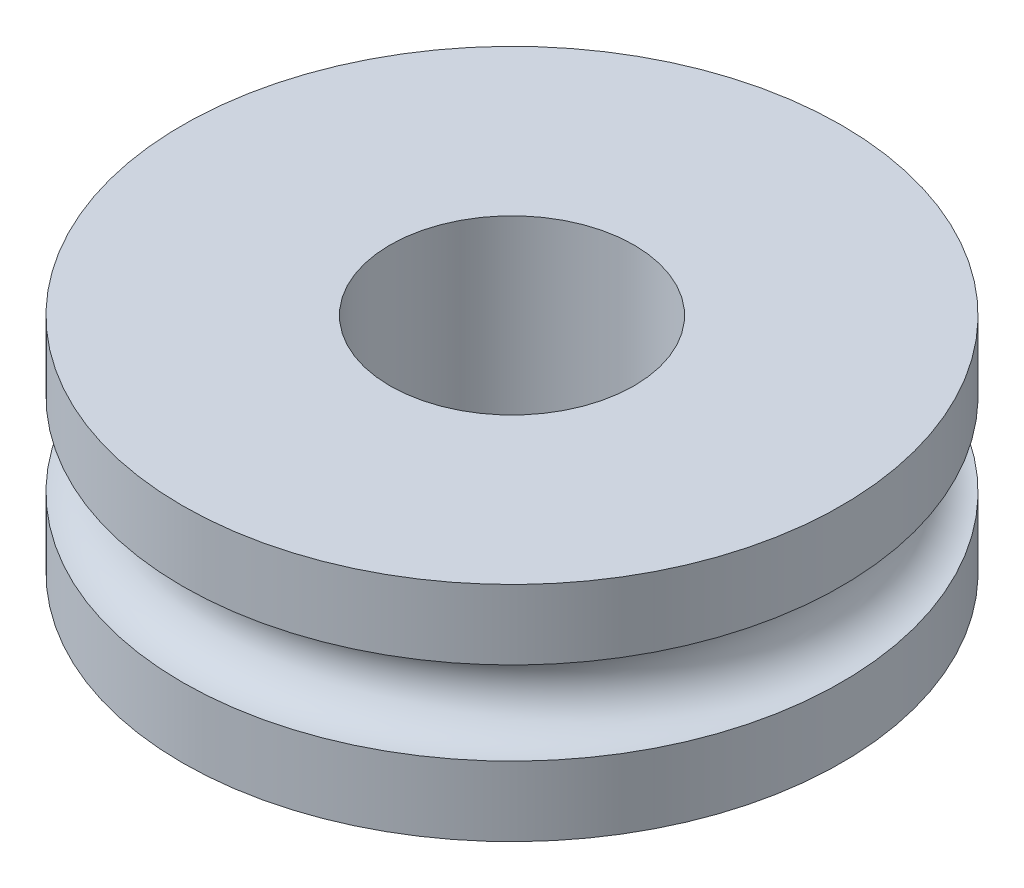
ISO-10303-21;
HEADER;
FILE_DESCRIPTION(('STEP AP214'),'2;1');
FILE_NAME('part.step','',(''),(''),'','','');
FILE_SCHEMA(('AUTOMOTIVE_DESIGN { 1 0 10303 214 1 1 1 1 }'));
ENDSEC;
DATA;
#1=APPLICATION_CONTEXT('core data for automotive mechanical design processes');
#2=APPLICATION_PROTOCOL_DEFINITION('international standard','automotive_design',2000,#1);
#3=PRODUCT_CONTEXT('',#1,'mechanical');
#4=PRODUCT('Part','Part','',(#3));
#5=PRODUCT_RELATED_PRODUCT_CATEGORY('part','',(#4));
#6=PRODUCT_DEFINITION_FORMATION('','',#4);
#7=PRODUCT_DEFINITION_CONTEXT('part definition',#1,'design');
#8=PRODUCT_DEFINITION('design','',#6,#7);
#9=PRODUCT_DEFINITION_SHAPE('','',#8);
#10=(LENGTH_UNIT() NAMED_UNIT(*) SI_UNIT(.MILLI.,.METRE.));
#11=(NAMED_UNIT(*) PLANE_ANGLE_UNIT() SI_UNIT($,.RADIAN.));
#12=(NAMED_UNIT(*) SI_UNIT($,.STERADIAN.) SOLID_ANGLE_UNIT());
#13=UNCERTAINTY_MEASURE_WITH_UNIT(LENGTH_MEASURE(1.E-05),#10,'distance_accuracy_value','');
#14=(GEOMETRIC_REPRESENTATION_CONTEXT(3) GLOBAL_UNCERTAINTY_ASSIGNED_CONTEXT((#13)) GLOBAL_UNIT_ASSIGNED_CONTEXT((#10,
#11,#12)) REPRESENTATION_CONTEXT('',''));
#15=CARTESIAN_POINT('',(0.,0.,0.));
#16=DIRECTION('',(0.,0.,1.));
#17=DIRECTION('',(1.,0.,0.));
#18=AXIS2_PLACEMENT_3D('',#15,#16,#17);
#19=CARTESIAN_POINT('',(0.,0.,0.));
#20=DIRECTION('',(0.,-1.,0.));
#21=DIRECTION('',(0.,0.,-1.));
#22=AXIS2_PLACEMENT_3D('',#19,#20,#21);
#23=CYLINDRICAL_SURFACE('',#22,76.0841811929325);
#24=CARTESIAN_POINT('',(0.,0.,0.));
#25=DIRECTION('',(0.,-1.,0.));
#26=DIRECTION('',(0.,0.,-1.));
#27=AXIS2_PLACEMENT_3D('',#24,#25,#26);
#28=CIRCLE('',#27,76.0841811929325);
#29=CARTESIAN_POINT('',(0.,0.,-76.0841811929325));
#30=VERTEX_POINT('',#29);
#31=EDGE_CURVE('E46',#30,#30,#28,.T.);
#32=ORIENTED_EDGE('',*,*,#31,.F.);
#33=EDGE_LOOP('',(#32));
#34=FACE_BOUND('',#33,.T.);
#35=CARTESIAN_POINT('',(0.,16.0993235735429,0.));
#36=DIRECTION('',(0.,1.,0.));
#37=DIRECTION('',(0.,0.,1.));
#38=AXIS2_PLACEMENT_3D('',#35,#36,#37);
#39=CIRCLE('',#38,76.0841811929325);
#40=CARTESIAN_POINT('',(0.,16.0993235735429,76.0841811929325));
#41=VERTEX_POINT('',#40);
#42=EDGE_CURVE('E37',#41,#41,#39,.T.);
#43=ORIENTED_EDGE('',*,*,#42,.F.);
#44=EDGE_LOOP('',(#43));
#45=FACE_BOUND('',#44,.T.);
#46=ADVANCED_FACE('F33',(#34,#45),#23,.T.);
#47=CARTESIAN_POINT('',(0.,51.4164235740543,0.));
#48=DIRECTION('',(0.,-1.,0.));
#49=DIRECTION('',(0.,0.,-1.));
#50=AXIS2_PLACEMENT_3D('',#47,#48,#49);
#51=CIRCLE('',#50,76.0841811929325);
#52=CARTESIAN_POINT('',(0.,51.4164235740543,-76.0841811929325));
#53=VERTEX_POINT('',#52);
#54=EDGE_CURVE('E41',#53,#53,#51,.T.);
#55=ORIENTED_EDGE('',*,*,#54,.T.);
#56=EDGE_LOOP('',(#55));
#57=FACE_BOUND('',#56,.T.);
#58=CARTESIAN_POINT('',(0.,35.3171000005114,0.));
#59=DIRECTION('',(0.,-1.,0.));
#60=DIRECTION('',(0.,0.,-1.));
#61=AXIS2_PLACEMENT_3D('',#58,#59,#60);
#62=CIRCLE('',#61,76.0841811929325);
#63=CARTESIAN_POINT('',(0.,35.3171000005114,-76.0841811929325));
#64=VERTEX_POINT('',#63);
#65=EDGE_CURVE('E49',#64,#64,#62,.T.);
#66=ORIENTED_EDGE('',*,*,#65,.F.);
#67=EDGE_LOOP('',(#66));
#68=FACE_BOUND('',#67,.T.);
#69=ADVANCED_FACE('F68',(#57,#68),#23,.T.);
#70=CARTESIAN_POINT('',(0.,0.,0.));
#71=DIRECTION('',(0.,-1.,0.));
#72=DIRECTION('',(0.,0.,-1.));
#73=AXIS2_PLACEMENT_3D('',#70,#71,#72);
#74=CYLINDRICAL_SURFACE('',#73,28.1754180007115);
#75=CARTESIAN_POINT('',(0.,51.4164235740543,0.));
#76=DIRECTION('',(0.,-1.,0.));
#77=DIRECTION('',(0.,0.,-1.));
#78=AXIS2_PLACEMENT_3D('',#75,#76,#77);
#79=CIRCLE('',#78,28.1754180007115);
#80=CARTESIAN_POINT('',(0.,51.4164235740543,-28.1754180007115));
#81=VERTEX_POINT('',#80);
#82=EDGE_CURVE('E10',#81,#81,#79,.T.);
#83=ORIENTED_EDGE('',*,*,#82,.F.);
#84=EDGE_LOOP('',(#83));
#85=FACE_BOUND('',#84,.T.);
#86=CARTESIAN_POINT('',(0.,0.,0.));
#87=DIRECTION('',(0.,-1.,0.));
#88=DIRECTION('',(0.,0.,-1.));
#89=AXIS2_PLACEMENT_3D('',#86,#87,#88);
#90=CIRCLE('',#89,28.1754180007115);
#91=CARTESIAN_POINT('',(0.,0.,-28.1754180007115));
#92=VERTEX_POINT('',#91);
#93=EDGE_CURVE('E54',#92,#92,#90,.T.);
#94=ORIENTED_EDGE('',*,*,#93,.T.);
#95=EDGE_LOOP('',(#94));
#96=FACE_BOUND('',#95,.T.);
#97=ADVANCED_FACE('F35',(#85,#96),#74,.F.);
#98=CARTESIAN_POINT('',(-28.1754180007115,51.4164235740543,0.));
#99=DIRECTION('',(0.,-1.,0.));
#100=DIRECTION('',(0.,0.,-1.));
#101=AXIS2_PLACEMENT_3D('',#98,#99,#100);
#102=PLANE('',#101);
#103=ORIENTED_EDGE('',*,*,#54,.F.);
#104=EDGE_LOOP('',(#103));
#105=FACE_BOUND('',#104,.T.);
#106=ORIENTED_EDGE('',*,*,#82,.T.);
#107=EDGE_LOOP('',(#106));
#108=FACE_BOUND('',#107,.T.);
#109=ADVANCED_FACE('F76',(#105,#108),#102,.F.);
#110=CARTESIAN_POINT('',(-28.1754180007115,0.,0.));
#111=DIRECTION('',(0.,1.,0.));
#112=DIRECTION('',(0.,0.,1.));
#113=AXIS2_PLACEMENT_3D('',#110,#111,#112);
#114=PLANE('',#113);
#115=ORIENTED_EDGE('',*,*,#93,.F.);
#116=EDGE_LOOP('',(#115));
#117=FACE_BOUND('',#116,.T.);
#118=ORIENTED_EDGE('',*,*,#31,.T.);
#119=EDGE_LOOP('',(#118));
#120=FACE_BOUND('',#119,.T.);
#121=ADVANCED_FACE('F64',(#117,#120),#114,.F.);
#122=CARTESIAN_POINT('',(0.,25.7082117870272,0.));
#123=DIRECTION('',(0.,-1.,0.));
#124=DIRECTION('',(0.,0.,-1.));
#125=AXIS2_PLACEMENT_3D('',#122,#123,#124);
#126=TOROIDAL_SURFACE('',#125,76.0841811929325,9.60888821348428);
#127=ORIENTED_EDGE('',*,*,#65,.T.);
#128=EDGE_LOOP('',(#127));
#129=FACE_BOUND('',#128,.T.);
#130=ORIENTED_EDGE('',*,*,#42,.T.);
#131=EDGE_LOOP('',(#130));
#132=FACE_BOUND('',#131,.T.);
#133=ADVANCED_FACE('F83',(#129,#132),#126,.F.);
#134=CLOSED_SHELL('',(#46,#69,#97,#109,#121,#133));
#135=MANIFOLD_SOLID_BREP('B2',#134);
#136=ADVANCED_BREP_SHAPE_REPRESENTATION('',(#18,#135),#14);
#137=SHAPE_DEFINITION_REPRESENTATION(#9,#136);
ENDSEC;
END-ISO-10303-21;
